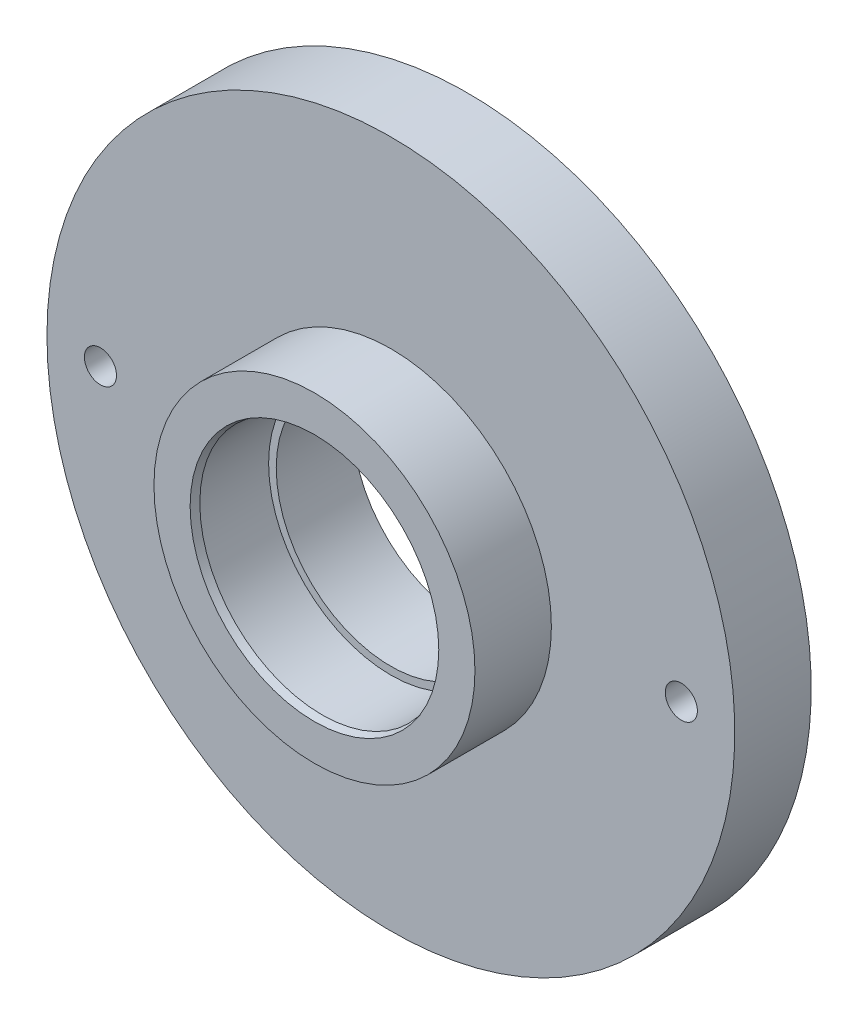
ISO-10303-21;
HEADER;
FILE_DESCRIPTION(('STEP AP214'),'2;1');
FILE_NAME('part.step','',(''),(''),'','','');
FILE_SCHEMA(('AUTOMOTIVE_DESIGN { 1 0 10303 214 1 1 1 1 }'));
ENDSEC;
DATA;
#1=APPLICATION_CONTEXT('core data for automotive mechanical design processes');
#2=APPLICATION_PROTOCOL_DEFINITION('international standard','automotive_design',2000,#1);
#3=PRODUCT_CONTEXT('',#1,'mechanical');
#4=PRODUCT('Part','Part','',(#3));
#5=PRODUCT_RELATED_PRODUCT_CATEGORY('part','',(#4));
#6=PRODUCT_DEFINITION_FORMATION('','',#4);
#7=PRODUCT_DEFINITION_CONTEXT('part definition',#1,'design');
#8=PRODUCT_DEFINITION('design','',#6,#7);
#9=PRODUCT_DEFINITION_SHAPE('','',#8);
#10=(LENGTH_UNIT() NAMED_UNIT(*) SI_UNIT(.MILLI.,.METRE.));
#11=(NAMED_UNIT(*) PLANE_ANGLE_UNIT() SI_UNIT($,.RADIAN.));
#12=(NAMED_UNIT(*) SI_UNIT($,.STERADIAN.) SOLID_ANGLE_UNIT());
#13=UNCERTAINTY_MEASURE_WITH_UNIT(LENGTH_MEASURE(1.E-05),#10,'distance_accuracy_value','');
#14=(GEOMETRIC_REPRESENTATION_CONTEXT(3) GLOBAL_UNCERTAINTY_ASSIGNED_CONTEXT((#13)) GLOBAL_UNIT_ASSIGNED_CONTEXT((#10,
#11,#12)) REPRESENTATION_CONTEXT('',''));
#15=CARTESIAN_POINT('',(0.,0.,0.));
#16=DIRECTION('',(0.,0.,1.));
#17=DIRECTION('',(1.,0.,0.));
#18=AXIS2_PLACEMENT_3D('',#15,#16,#17);
#19=CARTESIAN_POINT('',(16.,0.,0.));
#20=DIRECTION('',(0.,0.,-1.));
#21=DIRECTION('',(-1.,0.,0.));
#22=AXIS2_PLACEMENT_3D('',#19,#20,#21);
#23=PLANE('',#22);
#24=CARTESIAN_POINT('',(0.,0.,0.));
#25=DIRECTION('',(0.,0.,-1.));
#26=DIRECTION('',(-1.,0.,0.));
#27=AXIS2_PLACEMENT_3D('',#24,#25,#26);
#28=CIRCLE('',#27,16.2679491924312);
#29=CARTESIAN_POINT('',(-16.2679491924312,0.,0.));
#30=VERTEX_POINT('',#29);
#31=EDGE_CURVE('E40',#30,#30,#28,.T.);
#32=ORIENTED_EDGE('',*,*,#31,.T.);
#33=EDGE_LOOP('',(#32));
#34=FACE_BOUND('',#33,.T.);
#35=CARTESIAN_POINT('',(0.,0.,0.));
#36=DIRECTION('',(0.,0.,-1.));
#37=DIRECTION('',(-1.,0.,0.));
#38=AXIS2_PLACEMENT_3D('',#35,#36,#37);
#39=CIRCLE('',#38,21.);
#40=CARTESIAN_POINT('',(-21.,0.,0.));
#41=VERTEX_POINT('',#40);
#42=EDGE_CURVE('E44',#41,#41,#39,.T.);
#43=ORIENTED_EDGE('',*,*,#42,.F.);
#44=EDGE_LOOP('',(#43));
#45=FACE_BOUND('',#44,.T.);
#46=ADVANCED_FACE('F33',(#34,#45),#23,.F.);
#47=CARTESIAN_POINT('',(0.,0.,0.));
#48=DIRECTION('',(0.,0.,-1.));
#49=DIRECTION('',(-1.,0.,0.));
#50=AXIS2_PLACEMENT_3D('',#47,#48,#49);
#51=CYLINDRICAL_SURFACE('',#50,21.);
#52=CARTESIAN_POINT('',(0.,0.,-10.));
#53=DIRECTION('',(0.,0.,-1.));
#54=DIRECTION('',(-1.,0.,0.));
#55=AXIS2_PLACEMENT_3D('',#52,#53,#54);
#56=CIRCLE('',#55,21.);
#57=CARTESIAN_POINT('',(-21.,0.,-10.));
#58=VERTEX_POINT('',#57);
#59=EDGE_CURVE('E48',#58,#58,#56,.T.);
#60=ORIENTED_EDGE('',*,*,#59,.F.);
#61=EDGE_LOOP('',(#60));
#62=FACE_BOUND('',#61,.T.);
#63=ORIENTED_EDGE('',*,*,#42,.T.);
#64=EDGE_LOOP('',(#63));
#65=FACE_BOUND('',#64,.T.);
#66=ADVANCED_FACE('F87',(#62,#65),#51,.T.);
#67=CARTESIAN_POINT('',(21.,0.,-10.));
#68=DIRECTION('',(0.,0.,-1.));
#69=DIRECTION('',(-1.,0.,0.));
#70=AXIS2_PLACEMENT_3D('',#67,#68,#69);
#71=PLANE('',#70);
#72=CARTESIAN_POINT('',(-38.,0.,-10.));
#73=DIRECTION('',(0.,0.,1.));
#74=DIRECTION('',(1.,0.,0.));
#75=AXIS2_PLACEMENT_3D('',#72,#73,#74);
#76=CIRCLE('',#75,2.09999999999999);
#77=CARTESIAN_POINT('',(-35.9,0.,-10.));
#78=VERTEX_POINT('',#77);
#79=EDGE_CURVE('E77',#78,#78,#76,.T.);
#80=ORIENTED_EDGE('',*,*,#79,.F.);
#81=EDGE_LOOP('',(#80));
#82=FACE_BOUND('',#81,.T.);
#83=CARTESIAN_POINT('',(38.,0.,-10.));
#84=DIRECTION('',(0.,0.,1.));
#85=DIRECTION('',(1.,0.,0.));
#86=AXIS2_PLACEMENT_3D('',#83,#84,#85);
#87=CIRCLE('',#86,2.09999999999999);
#88=CARTESIAN_POINT('',(40.1,0.,-10.));
#89=VERTEX_POINT('',#88);
#90=EDGE_CURVE('E71',#89,#89,#87,.T.);
#91=ORIENTED_EDGE('',*,*,#90,.F.);
#92=EDGE_LOOP('',(#91));
#93=FACE_BOUND('',#92,.T.);
#94=CARTESIAN_POINT('',(0.,0.,-10.));
#95=DIRECTION('',(0.,0.,-1.));
#96=DIRECTION('',(-1.,0.,0.));
#97=AXIS2_PLACEMENT_3D('',#94,#95,#96);
#98=CIRCLE('',#97,45.);
#99=CARTESIAN_POINT('',(-45.,0.,-10.));
#100=VERTEX_POINT('',#99);
#101=EDGE_CURVE('E53',#100,#100,#98,.T.);
#102=ORIENTED_EDGE('',*,*,#101,.F.);
#103=EDGE_LOOP('',(#102));
#104=FACE_BOUND('',#103,.T.);
#105=ORIENTED_EDGE('',*,*,#59,.T.);
#106=EDGE_LOOP('',(#105));
#107=FACE_BOUND('',#106,.T.);
#108=ADVANCED_FACE('F83',(#82,#93,#104,#107),#71,.F.);
#109=CARTESIAN_POINT('',(0.,0.,0.));
#110=DIRECTION('',(0.,0.,-1.));
#111=DIRECTION('',(-1.,0.,0.));
#112=AXIS2_PLACEMENT_3D('',#109,#110,#111);
#113=CYLINDRICAL_SURFACE('',#112,45.);
#114=CARTESIAN_POINT('',(0.,0.,-20.));
#115=DIRECTION('',(0.,0.,-1.));
#116=DIRECTION('',(-1.,0.,0.));
#117=AXIS2_PLACEMENT_3D('',#114,#115,#116);
#118=CIRCLE('',#117,45.);
#119=CARTESIAN_POINT('',(-45.,0.,-20.));
#120=VERTEX_POINT('',#119);
#121=EDGE_CURVE('E56',#120,#120,#118,.T.);
#122=ORIENTED_EDGE('',*,*,#121,.F.);
#123=EDGE_LOOP('',(#122));
#124=FACE_BOUND('',#123,.T.);
#125=ORIENTED_EDGE('',*,*,#101,.T.);
#126=EDGE_LOOP('',(#125));
#127=FACE_BOUND('',#126,.T.);
#128=ADVANCED_FACE('F86',(#124,#127),#113,.T.);
#129=CARTESIAN_POINT('',(45.,0.,-20.));
#130=DIRECTION('',(0.,0.,1.));
#131=DIRECTION('',(1.,0.,0.));
#132=AXIS2_PLACEMENT_3D('',#129,#130,#131);
#133=PLANE('',#132);
#134=CARTESIAN_POINT('',(-38.,0.,-20.));
#135=DIRECTION('',(0.,0.,1.));
#136=DIRECTION('',(1.,0.,0.));
#137=AXIS2_PLACEMENT_3D('',#134,#135,#136);
#138=CIRCLE('',#137,2.1);
#139=CARTESIAN_POINT('',(-35.9,0.,-20.));
#140=VERTEX_POINT('',#139);
#141=EDGE_CURVE('E74',#140,#140,#138,.T.);
#142=ORIENTED_EDGE('',*,*,#141,.T.);
#143=EDGE_LOOP('',(#142));
#144=FACE_BOUND('',#143,.T.);
#145=CARTESIAN_POINT('',(38.,0.,-20.));
#146=DIRECTION('',(0.,0.,1.));
#147=DIRECTION('',(1.,0.,0.));
#148=AXIS2_PLACEMENT_3D('',#145,#146,#147);
#149=CIRCLE('',#148,2.1);
#150=CARTESIAN_POINT('',(40.1,0.,-20.));
#151=VERTEX_POINT('',#150);
#152=EDGE_CURVE('E68',#151,#151,#149,.T.);
#153=ORIENTED_EDGE('',*,*,#152,.T.);
#154=EDGE_LOOP('',(#153));
#155=FACE_BOUND('',#154,.T.);
#156=CARTESIAN_POINT('',(0.,0.,-20.));
#157=DIRECTION('',(0.,0.,-1.));
#158=DIRECTION('',(-1.,0.,0.));
#159=AXIS2_PLACEMENT_3D('',#156,#157,#158);
#160=CIRCLE('',#159,15.);
#161=CARTESIAN_POINT('',(-15.,0.,-20.));
#162=VERTEX_POINT('',#161);
#163=EDGE_CURVE('E59',#162,#162,#160,.T.);
#164=ORIENTED_EDGE('',*,*,#163,.F.);
#165=EDGE_LOOP('',(#164));
#166=FACE_BOUND('',#165,.T.);
#167=ORIENTED_EDGE('',*,*,#121,.T.);
#168=EDGE_LOOP('',(#167));
#169=FACE_BOUND('',#168,.T.);
#170=ADVANCED_FACE('F106',(#144,#155,#166,#169),#133,.F.);
#171=CARTESIAN_POINT('',(0.,0.,0.));
#172=DIRECTION('',(0.,0.,-1.));
#173=DIRECTION('',(-1.,0.,0.));
#174=AXIS2_PLACEMENT_3D('',#171,#172,#173);
#175=CYLINDRICAL_SURFACE('',#174,15.);
#176=CARTESIAN_POINT('',(0.,0.,-10.));
#177=DIRECTION('',(0.,0.,-1.));
#178=DIRECTION('',(-1.,0.,0.));
#179=AXIS2_PLACEMENT_3D('',#176,#177,#178);
#180=CIRCLE('',#179,15.);
#181=CARTESIAN_POINT('',(-15.,0.,-10.));
#182=VERTEX_POINT('',#181);
#183=EDGE_CURVE('E62',#182,#182,#180,.T.);
#184=ORIENTED_EDGE('',*,*,#183,.F.);
#185=EDGE_LOOP('',(#184));
#186=FACE_BOUND('',#185,.T.);
#187=ORIENTED_EDGE('',*,*,#163,.T.);
#188=EDGE_LOOP('',(#187));
#189=FACE_BOUND('',#188,.T.);
#190=ADVANCED_FACE('F110',(#186,#189),#175,.F.);
#191=CARTESIAN_POINT('',(16.,0.,-10.));
#192=DIRECTION('',(0.,0.,-1.));
#193=DIRECTION('',(-1.,0.,0.));
#194=AXIS2_PLACEMENT_3D('',#191,#192,#193);
#195=PLANE('',#194);
#196=CARTESIAN_POINT('',(0.,0.,-10.));
#197=DIRECTION('',(0.,0.,-1.));
#198=DIRECTION('',(-1.,0.,0.));
#199=AXIS2_PLACEMENT_3D('',#196,#197,#198);
#200=CIRCLE('',#199,16.);
#201=CARTESIAN_POINT('',(-16.,0.,-10.));
#202=VERTEX_POINT('',#201);
#203=EDGE_CURVE('E65',#202,#202,#200,.T.);
#204=ORIENTED_EDGE('',*,*,#203,.F.);
#205=EDGE_LOOP('',(#204));
#206=FACE_BOUND('',#205,.T.);
#207=ORIENTED_EDGE('',*,*,#183,.T.);
#208=EDGE_LOOP('',(#207));
#209=FACE_BOUND('',#208,.T.);
#210=ADVANCED_FACE('F114',(#206,#209),#195,.F.);
#211=CARTESIAN_POINT('',(0.,0.,0.));
#212=DIRECTION('',(0.,0.,-1.));
#213=DIRECTION('',(-1.,0.,0.));
#214=AXIS2_PLACEMENT_3D('',#211,#212,#213);
#215=CYLINDRICAL_SURFACE('',#214,16.);
#216=CARTESIAN_POINT('',(0.,0.,-1.00000000000013));
#217=DIRECTION('',(0.,0.,-1.));
#218=DIRECTION('',(-1.,0.,0.));
#219=AXIS2_PLACEMENT_3D('',#216,#217,#218);
#220=CIRCLE('',#219,16.);
#221=CARTESIAN_POINT('',(-16.,0.,-1.00000000000013));
#222=VERTEX_POINT('',#221);
#223=EDGE_CURVE('E10',#222,#222,#220,.F.);
#224=ORIENTED_EDGE('',*,*,#223,.T.);
#225=EDGE_LOOP('',(#224));
#226=FACE_BOUND('',#225,.T.);
#227=ORIENTED_EDGE('',*,*,#203,.T.);
#228=EDGE_LOOP('',(#227));
#229=FACE_BOUND('',#228,.T.);
#230=ADVANCED_FACE('F118',(#226,#229),#215,.F.);
#231=CARTESIAN_POINT('',(0.,0.,0.));
#232=DIRECTION('',(0.,0.,1.));
#233=DIRECTION('',(1.,0.,0.));
#234=AXIS2_PLACEMENT_3D('',#231,#232,#233);
#235=CONICAL_SURFACE('',#234,16.2679491924312,0.261799387799146);
#236=ORIENTED_EDGE('',*,*,#223,.F.);
#237=EDGE_LOOP('',(#236));
#238=FACE_BOUND('',#237,.T.);
#239=ORIENTED_EDGE('',*,*,#31,.F.);
#240=EDGE_LOOP('',(#239));
#241=FACE_BOUND('',#240,.T.);
#242=ADVANCED_FACE('F35',(#238,#241),#235,.F.);
#243=CARTESIAN_POINT('',(38.,0.,-10.));
#244=DIRECTION('',(0.,0.,1.));
#245=DIRECTION('',(1.,0.,0.));
#246=AXIS2_PLACEMENT_3D('',#243,#244,#245);
#247=CYLINDRICAL_SURFACE('',#246,2.09999999999999);
#248=ORIENTED_EDGE('',*,*,#152,.F.);
#249=EDGE_LOOP('',(#248));
#250=FACE_BOUND('',#249,.T.);
#251=ORIENTED_EDGE('',*,*,#90,.T.);
#252=EDGE_LOOP('',(#251));
#253=FACE_BOUND('',#252,.T.);
#254=ADVANCED_FACE('F122',(#250,#253),#247,.F.);
#255=CARTESIAN_POINT('',(-38.,0.,-10.));
#256=DIRECTION('',(0.,0.,1.));
#257=DIRECTION('',(1.,0.,0.));
#258=AXIS2_PLACEMENT_3D('',#255,#256,#257);
#259=CYLINDRICAL_SURFACE('',#258,2.09999999999999);
#260=ORIENTED_EDGE('',*,*,#141,.F.);
#261=EDGE_LOOP('',(#260));
#262=FACE_BOUND('',#261,.T.);
#263=ORIENTED_EDGE('',*,*,#79,.T.);
#264=EDGE_LOOP('',(#263));
#265=FACE_BOUND('',#264,.T.);
#266=ADVANCED_FACE('F81',(#262,#265),#259,.F.);
#267=CLOSED_SHELL('',(#46,#66,#108,#128,#170,#190,#210,#230,#242,#254,#266));
#268=MANIFOLD_SOLID_BREP('B2',#267);
#269=ADVANCED_BREP_SHAPE_REPRESENTATION('',(#18,#268),#14);
#270=SHAPE_DEFINITION_REPRESENTATION(#9,#269);
ENDSEC;
END-ISO-10303-21;
